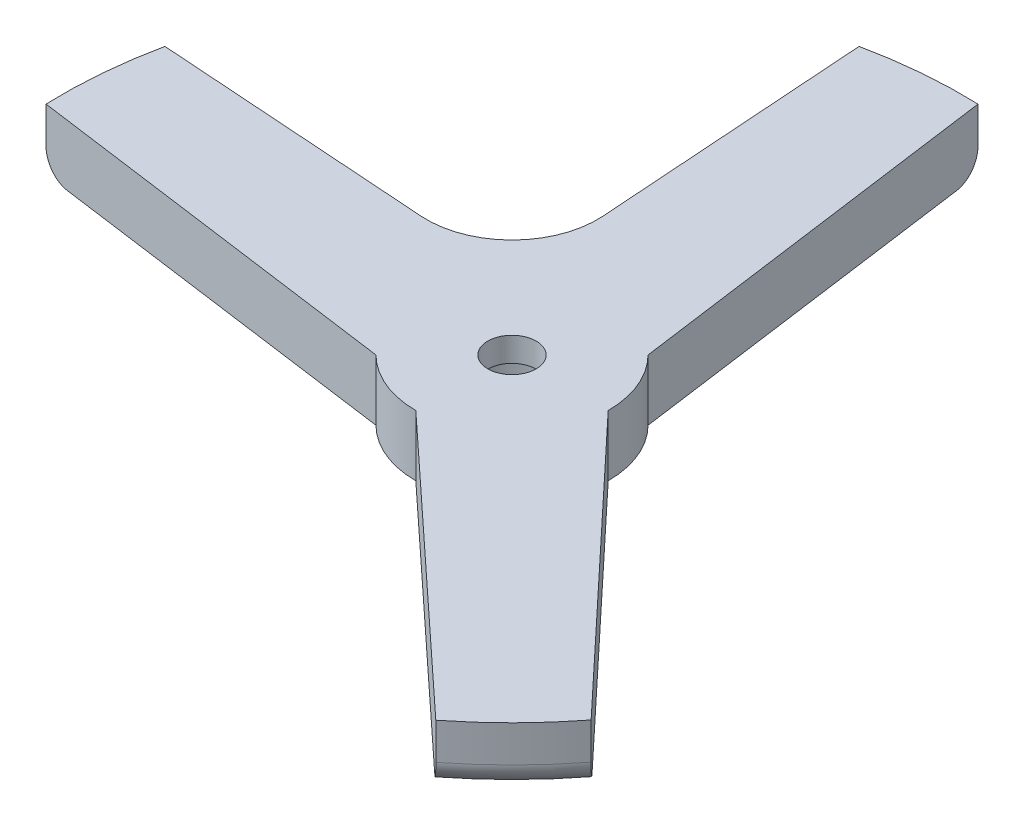
ISO-10303-21;
HEADER;
FILE_DESCRIPTION(('STEP AP214'),'2;1');
FILE_NAME('part.step','',(''),(''),'','','');
FILE_SCHEMA(('AUTOMOTIVE_DESIGN { 1 0 10303 214 1 1 1 1 }'));
ENDSEC;
DATA;
#1=APPLICATION_CONTEXT('core data for automotive mechanical design processes');
#2=APPLICATION_PROTOCOL_DEFINITION('international standard','automotive_design',2000,#1);
#3=PRODUCT_CONTEXT('',#1,'mechanical');
#4=PRODUCT('Part','Part','',(#3));
#5=PRODUCT_RELATED_PRODUCT_CATEGORY('part','',(#4));
#6=PRODUCT_DEFINITION_FORMATION('','',#4);
#7=PRODUCT_DEFINITION_CONTEXT('part definition',#1,'design');
#8=PRODUCT_DEFINITION('design','',#6,#7);
#9=PRODUCT_DEFINITION_SHAPE('','',#8);
#10=(LENGTH_UNIT() NAMED_UNIT(*) SI_UNIT(.MILLI.,.METRE.));
#11=(NAMED_UNIT(*) PLANE_ANGLE_UNIT() SI_UNIT($,.RADIAN.));
#12=(NAMED_UNIT(*) SI_UNIT($,.STERADIAN.) SOLID_ANGLE_UNIT());
#13=UNCERTAINTY_MEASURE_WITH_UNIT(LENGTH_MEASURE(1.E-05),#10,'distance_accuracy_value','');
#14=(GEOMETRIC_REPRESENTATION_CONTEXT(3) GLOBAL_UNCERTAINTY_ASSIGNED_CONTEXT((#13)) GLOBAL_UNIT_ASSIGNED_CONTEXT((#10,
#11,#12)) REPRESENTATION_CONTEXT('',''));
#15=CARTESIAN_POINT('',(0.,0.,0.));
#16=DIRECTION('',(0.,0.,1.));
#17=DIRECTION('',(1.,0.,0.));
#18=AXIS2_PLACEMENT_3D('',#15,#16,#17);
#19=CARTESIAN_POINT('',(0.,15.,0.));
#20=DIRECTION('',(0.,-1.,0.));
#21=DIRECTION('',(0.,0.,-1.));
#22=AXIS2_PLACEMENT_3D('',#19,#20,#21);
#23=CYLINDRICAL_SURFACE('',#22,37.);
#24=CARTESIAN_POINT('',(0.,-32.,0.));
#25=DIRECTION('',(0.,1.,0.));
#26=DIRECTION('',(0.,0.,1.));
#27=AXIS2_PLACEMENT_3D('',#24,#25,#26);
#28=CIRCLE('',#27,37.);
#29=CARTESIAN_POINT('',(22.8465313192423,-32.,29.1038830172003));
#30=VERTEX_POINT('',#29);
#31=CARTESIAN_POINT('',(29.2087582481236,-32.,22.7122971449977));
#32=VERTEX_POINT('',#31);
#33=EDGE_CURVE('E161',#30,#32,#28,.T.);
#34=ORIENTED_EDGE('',*,*,#33,.F.);
#35=DIRECTION('',(0.,1.,0.));
#36=VECTOR('',#35,1.);
#37=CARTESIAN_POINT('',(22.8465313192423,-37.,29.1038830172003));
#38=LINE('',#37,#36);
#39=CARTESIAN_POINT('',(22.8465313192423,-35.,29.1038830172003));
#40=VERTEX_POINT('',#39);
#41=EDGE_CURVE('E146',#40,#30,#38,.T.);
#42=ORIENTED_EDGE('',*,*,#41,.F.);
#43=CARTESIAN_POINT('',(0.,-35.,0.));
#44=DIRECTION('',(0.,-1.,0.));
#45=DIRECTION('',(0.,0.,-1.));
#46=AXIS2_PLACEMENT_3D('',#43,#44,#45);
#47=CIRCLE('',#46,37.);
#48=CARTESIAN_POINT('',(29.2087582481236,-35.,22.7122971449977));
#49=VERTEX_POINT('',#48);
#50=EDGE_CURVE('E159',#40,#49,#47,.F.);
#51=ORIENTED_EDGE('',*,*,#50,.T.);
#52=DIRECTION('',(0.,1.,0.));
#53=VECTOR('',#52,1.);
#54=CARTESIAN_POINT('',(29.2087582481236,-37.,22.7122971449977));
#55=LINE('',#54,#53);
#56=EDGE_CURVE('E162',#49,#32,#55,.T.);
#57=ORIENTED_EDGE('',*,*,#56,.T.);
#58=EDGE_LOOP('',(#34,#42,#51,#57));
#59=FACE_BOUND('',#58,.T.);
#60=ADVANCED_FACE('F37',(#59),#23,.T.);
#61=CARTESIAN_POINT('',(1.29128137799266,-32.,-36.9774605997065));
#62=VERTEX_POINT('',#61);
#63=CARTESIAN_POINT('',(-7.69273256025703,-32.,-36.1914612271508));
#64=VERTEX_POINT('',#63);
#65=EDGE_CURVE('E292',#62,#64,#28,.T.);
#66=ORIENTED_EDGE('',*,*,#65,.F.);
#67=DIRECTION('',(0.,1.,0.));
#68=VECTOR('',#67,1.);
#69=CARTESIAN_POINT('',(1.29128137799266,-37.,-36.9774605997065));
#70=LINE('',#69,#68);
#71=CARTESIAN_POINT('',(1.29128137799266,-35.,-36.9774605997065));
#72=VERTEX_POINT('',#71);
#73=EDGE_CURVE('E332',#72,#62,#70,.T.);
#74=ORIENTED_EDGE('',*,*,#73,.F.);
#75=CARTESIAN_POINT('',(0.,-35.,0.));
#76=DIRECTION('',(0.,-1.,0.));
#77=DIRECTION('',(0.,0.,-1.));
#78=AXIS2_PLACEMENT_3D('',#75,#76,#77);
#79=CIRCLE('',#78,37.);
#80=CARTESIAN_POINT('',(-7.69273256025703,-35.,-36.1914612271508));
#81=VERTEX_POINT('',#80);
#82=EDGE_CURVE('E172',#72,#81,#79,.F.);
#83=ORIENTED_EDGE('',*,*,#82,.T.);
#84=DIRECTION('',(0.,1.,0.));
#85=VECTOR('',#84,1.);
#86=CARTESIAN_POINT('',(-7.69273256025703,-37.,-36.1914612271508));
#87=LINE('',#86,#85);
#88=EDGE_CURVE('E163',#81,#64,#87,.T.);
#89=ORIENTED_EDGE('',*,*,#88,.T.);
#90=EDGE_LOOP('',(#66,#74,#83,#89));
#91=FACE_BOUND('',#90,.T.);
#92=ADVANCED_FACE('F269',(#91),#23,.T.);
#93=CARTESIAN_POINT('',(-36.1914612271508,-32.,-7.6927325602571));
#94=VERTEX_POINT('',#93);
#95=CARTESIAN_POINT('',(-36.9774605997065,-32.,1.29128137799258));
#96=VERTEX_POINT('',#95);
#97=EDGE_CURVE('E283',#94,#96,#28,.T.);
#98=ORIENTED_EDGE('',*,*,#97,.F.);
#99=DIRECTION('',(0.,1.,0.));
#100=VECTOR('',#99,1.);
#101=CARTESIAN_POINT('',(-36.1914612271508,-37.,-7.6927325602571));
#102=LINE('',#101,#100);
#103=CARTESIAN_POINT('',(-36.1914612271508,-35.,-7.6927325602571));
#104=VERTEX_POINT('',#103);
#105=EDGE_CURVE('E285',#104,#94,#102,.T.);
#106=ORIENTED_EDGE('',*,*,#105,.F.);
#107=CARTESIAN_POINT('',(0.,-35.,0.));
#108=DIRECTION('',(0.,-1.,0.));
#109=DIRECTION('',(0.,0.,-1.));
#110=AXIS2_PLACEMENT_3D('',#107,#108,#109);
#111=CIRCLE('',#110,37.);
#112=CARTESIAN_POINT('',(-36.9774605997065,-35.,1.29128137799258));
#113=VERTEX_POINT('',#112);
#114=EDGE_CURVE('E168',#104,#113,#111,.F.);
#115=ORIENTED_EDGE('',*,*,#114,.T.);
#116=DIRECTION('',(0.,1.,0.));
#117=VECTOR('',#116,1.);
#118=CARTESIAN_POINT('',(-36.9774605997065,-37.,1.29128137799258));
#119=LINE('',#118,#117);
#120=EDGE_CURVE('E288',#113,#96,#119,.T.);
#121=ORIENTED_EDGE('',*,*,#120,.T.);
#122=EDGE_LOOP('',(#98,#106,#115,#121));
#123=FACE_BOUND('',#122,.T.);
#124=ADVANCED_FACE('F270',(#123),#23,.T.);
#125=CARTESIAN_POINT('',(0.,-37.,0.));
#126=DIRECTION('',(0.,-1.,0.));
#127=DIRECTION('',(0.,0.,-1.));
#128=AXIS2_PLACEMENT_3D('',#125,#126,#127);
#129=PLANE('',#128);
#130=DIRECTION('',(0.997639543397483,0.,0.0686683438686374));
#131=VECTOR('',#130,1.);
#132=CARTESIAN_POINT('',(-36.1914612271508,-37.,-7.6927325602571));
#133=LINE('',#132,#131);
#134=CARTESIAN_POINT('',(-34.1751066058086,-37.,-7.55394522627882));
#135=VERTEX_POINT('',#134);
#136=CARTESIAN_POINT('',(-13.6020394357341,-37.,-6.13788422487123));
#137=VERTEX_POINT('',#136);
#138=EDGE_CURVE('E342',#135,#137,#133,.T.);
#139=ORIENTED_EDGE('',*,*,#138,.T.);
#140=CARTESIAN_POINT('',(-13.1213610286536,-37.,-13.1213610286536));
#141=DIRECTION('',(0.,-1.,0.));
#142=DIRECTION('',(0.,0.,-1.));
#143=AXIS2_PLACEMENT_3D('',#140,#141,#142);
#144=CIRCLE('',#143,7.);
#145=CARTESIAN_POINT('',(-6.13788422487122,-37.,-13.6020394357341));
#146=VERTEX_POINT('',#145);
#147=EDGE_CURVE('E45',#137,#146,#144,.F.);
#148=ORIENTED_EDGE('',*,*,#147,.T.);
#149=DIRECTION('',(-0.068668343868635,0.,-0.997639543397483));
#150=VECTOR('',#149,1.);
#151=CARTESIAN_POINT('',(-7.69273256025703,-37.,-36.1914612271508));
#152=LINE('',#151,#150);
#153=CARTESIAN_POINT('',(-7.55394522627876,-37.,-34.1751066058086));
#154=VERTEX_POINT('',#153);
#155=EDGE_CURVE('E349',#146,#154,#152,.T.);
#156=ORIENTED_EDGE('',*,*,#155,.T.);
#157=CARTESIAN_POINT('',(0.,-37.,0.));
#158=DIRECTION('',(0.,-1.,0.));
#159=DIRECTION('',(0.,0.,-1.));
#160=AXIS2_PLACEMENT_3D('',#157,#158,#159);
#161=CIRCLE('',#160,35.);
#162=CARTESIAN_POINT('',(1.56663083980371,-37.,-34.9649205320386));
#163=VERTEX_POINT('',#162);
#164=EDGE_CURVE('E170',#154,#163,#161,.T.);
#165=ORIENTED_EDGE('',*,*,#164,.T.);
#166=DIRECTION('',(0.135554057971971,0.,0.990769951788674));
#167=VECTOR('',#166,1.);
#168=CARTESIAN_POINT('',(1.29128137799266,-37.,-36.9774605997065));
#169=LINE('',#168,#167);
#170=CARTESIAN_POINT('',(5.58614357137372,-37.,-5.58614357137372));
#171=VERTEX_POINT('',#170);
#172=EDGE_CURVE('E353',#163,#171,#169,.T.);
#173=ORIENTED_EDGE('',*,*,#172,.T.);
#174=CARTESIAN_POINT('',(0.,-37.,0.));
#175=DIRECTION('',(0.,-1.,0.));
#176=DIRECTION('',(0.,0.,-1.));
#177=AXIS2_PLACEMENT_3D('',#174,#175,#176);
#178=CIRCLE('',#177,7.9);
#179=CARTESIAN_POINT('',(7.9,-37.,0.));
#180=VERTEX_POINT('',#179);
#181=EDGE_CURVE('E379',#171,#180,#178,.T.);
#182=ORIENTED_EDGE('',*,*,#181,.T.);
#183=DIRECTION('',(0.684214165270186,0.,0.729281136492384));
#184=VECTOR('',#183,1.);
#185=CARTESIAN_POINT('',(7.9,-37.,0.));
#186=LINE('',#185,#184);
#187=CARTESIAN_POINT('',(27.8224475975923,-37.,21.2346747015166));
#188=VERTEX_POINT('',#187);
#189=EDGE_CURVE('E314',#180,#188,#186,.T.);
#190=ORIENTED_EDGE('',*,*,#189,.T.);
#191=CARTESIAN_POINT('',(0.,-37.,0.));
#192=DIRECTION('',(0.,-1.,0.));
#193=DIRECTION('',(0.,0.,-1.));
#194=AXIS2_PLACEMENT_3D('',#191,#192,#193);
#195=CIRCLE('',#194,35.);
#196=CARTESIAN_POINT('',(21.3612459680109,-37.,27.7253885580372));
#197=VERTEX_POINT('',#196);
#198=EDGE_CURVE('E335',#188,#197,#195,.T.);
#199=ORIENTED_EDGE('',*,*,#198,.T.);
#200=DIRECTION('',(-0.732965488555828,0.,-0.680265824943541));
#201=VECTOR('',#200,1.);
#202=CARTESIAN_POINT('',(0.,-37.,7.9));
#203=LINE('',#202,#201);
#204=CARTESIAN_POINT('',(0.,-37.,7.9));
#205=VERTEX_POINT('',#204);
#206=EDGE_CURVE('E149',#197,#205,#203,.T.);
#207=ORIENTED_EDGE('',*,*,#206,.T.);
#208=CARTESIAN_POINT('',(0.,-37.,0.));
#209=DIRECTION('',(0.,-1.,0.));
#210=DIRECTION('',(0.,0.,-1.));
#211=AXIS2_PLACEMENT_3D('',#208,#209,#210);
#212=CIRCLE('',#211,7.9);
#213=CARTESIAN_POINT('',(-5.58614357137372,-37.,5.58614357137373));
#214=VERTEX_POINT('',#213);
#215=EDGE_CURVE('E351',#205,#214,#212,.T.);
#216=ORIENTED_EDGE('',*,*,#215,.T.);
#217=DIRECTION('',(-0.990769951788674,0.,-0.135554057971974));
#218=VECTOR('',#217,1.);
#219=CARTESIAN_POINT('',(-36.9774605997065,-37.,1.29128137799258));
#220=LINE('',#219,#218);
#221=CARTESIAN_POINT('',(-34.9649205320386,-37.,1.56663083980364));
#222=VERTEX_POINT('',#221);
#223=EDGE_CURVE('E348',#214,#222,#220,.T.);
#224=ORIENTED_EDGE('',*,*,#223,.T.);
#225=CARTESIAN_POINT('',(0.,-37.,0.));
#226=DIRECTION('',(0.,-1.,0.));
#227=DIRECTION('',(0.,0.,-1.));
#228=AXIS2_PLACEMENT_3D('',#225,#226,#227);
#229=CIRCLE('',#228,35.);
#230=EDGE_CURVE('E347',#222,#135,#229,.T.);
#231=ORIENTED_EDGE('',*,*,#230,.T.);
#232=EDGE_LOOP('',(#139,#148,#156,#165,#173,#182,#190,#199,#207,#216,#224,#231));
#233=FACE_BOUND('',#232,.T.);
#234=CARTESIAN_POINT('',(0.,-37.,0.));
#235=DIRECTION('',(0.,-1.,0.));
#236=DIRECTION('',(0.,0.,-1.));
#237=AXIS2_PLACEMENT_3D('',#234,#235,#236);
#238=CIRCLE('',#237,6.15);
#239=CARTESIAN_POINT('',(0.,-37.,-6.15));
#240=VERTEX_POINT('',#239);
#241=EDGE_CURVE('E323',#240,#240,#238,.T.);
#242=ORIENTED_EDGE('',*,*,#241,.F.);
#243=EDGE_LOOP('',(#242));
#244=FACE_BOUND('',#243,.T.);
#245=ADVANCED_FACE('F196',(#233,#244),#129,.T.);
#246=CARTESIAN_POINT('',(0.,-32.,0.));
#247=DIRECTION('',(0.,-1.,0.));
#248=DIRECTION('',(0.,0.,-1.));
#249=AXIS2_PLACEMENT_3D('',#246,#247,#248);
#250=CYLINDRICAL_SURFACE('',#249,1.984375);
#251=CARTESIAN_POINT('',(0.,-32.,0.));
#252=DIRECTION('',(0.,-1.,0.));
#253=DIRECTION('',(0.,0.,-1.));
#254=AXIS2_PLACEMENT_3D('',#251,#252,#253);
#255=CIRCLE('',#254,1.984375);
#256=CARTESIAN_POINT('',(0.,-32.,-1.984375));
#257=VERTEX_POINT('',#256);
#258=EDGE_CURVE('E315',#257,#257,#255,.T.);
#259=ORIENTED_EDGE('',*,*,#258,.F.);
#260=EDGE_LOOP('',(#259));
#261=FACE_BOUND('',#260,.T.);
#262=CARTESIAN_POINT('',(0.,-34.,0.));
#263=DIRECTION('',(0.,-1.,0.));
#264=DIRECTION('',(0.,0.,-1.));
#265=AXIS2_PLACEMENT_3D('',#262,#263,#264);
#266=CIRCLE('',#265,1.984375);
#267=CARTESIAN_POINT('',(0.,-34.,-1.984375));
#268=VERTEX_POINT('',#267);
#269=EDGE_CURVE('E318',#268,#268,#266,.F.);
#270=ORIENTED_EDGE('',*,*,#269,.F.);
#271=EDGE_LOOP('',(#270));
#272=FACE_BOUND('',#271,.T.);
#273=ADVANCED_FACE('F280',(#261,#272),#250,.F.);
#274=CARTESIAN_POINT('',(7.9,-32.,0.));
#275=DIRECTION('',(0.729281136492384,0.,-0.684214165270186));
#276=DIRECTION('',(-0.684214165270186,0.,-0.729281136492384));
#277=AXIS2_PLACEMENT_3D('',#274,#275,#276);
#278=PLANE('',#277);
#279=ORIENTED_EDGE('',*,*,#56,.F.);
#280=CARTESIAN_POINT('',(29.2087582481236,-35.,22.7122971449977));
#281=CARTESIAN_POINT('',(29.20875822779,-35.0557630965855,22.7122971233248));
#282=CARTESIAN_POINT('',(29.2071418260147,-35.1114993120202,22.7105742543993));
#283=CARTESIAN_POINT('',(29.2006949368529,-35.2225692292145,22.7037027295268));
#284=CARTESIAN_POINT('',(29.1958646782454,-35.2779029593417,22.6985543174277));
#285=CARTESIAN_POINT('',(29.176606217041,-35.4425718251851,22.6780273637528));
#286=CARTESIAN_POINT('',(29.1574101570931,-35.5507979938055,22.6575669215031));
#287=CARTESIAN_POINT('',(29.1068725311435,-35.7609914040277,22.6037005457995));
#288=CARTESIAN_POINT('',(29.075526513721,-35.8629563358,22.5702898677242));
#289=CARTESIAN_POINT('',(29.0016266932841,-36.0578054446676,22.4915225054415));
#290=CARTESIAN_POINT('',(28.9590738214319,-36.150690375329,22.4461668137289));
#291=CARTESIAN_POINT('',(28.8637627210728,-36.3252848889299,22.3445778798565));
#292=CARTESIAN_POINT('',(28.8109529959521,-36.406934371268,22.2882897491676));
#293=CARTESIAN_POINT('',(28.6967897182499,-36.5563124440695,22.1666069060837));
#294=CARTESIAN_POINT('',(28.6354343637445,-36.6240380910882,22.1012102730779));
#295=CARTESIAN_POINT('',(28.5051668564215,-36.7444825425909,21.962362466922));
#296=CARTESIAN_POINT('',(28.4361741409069,-36.7970150112516,21.888825424671));
#297=CARTESIAN_POINT('',(28.2931924669553,-36.8846144726145,21.7364260109059));
#298=CARTESIAN_POINT('',(28.2192054725813,-36.9196882862322,21.6575657328211));
#299=CARTESIAN_POINT('',(28.0911364943401,-36.963676372503,21.5210612657376));
#300=CARTESIAN_POINT('',(28.0377866209278,-36.9772910522329,21.4641974089385));
#301=CARTESIAN_POINT('',(27.9304467821274,-36.9954523219353,21.349787442579));
#302=CARTESIAN_POINT('',(27.8764578451485,-37.0000118967839,21.2922424291658));
#303=CARTESIAN_POINT('',(27.8224475975923,-37.,21.2346747015166));
#304=B_SPLINE_CURVE_WITH_KNOTS('',3,(#280,#281,#282,#283,#284,#285,#286,#287,#288,#289,#290,
#291,#292,#293,#294,#295,#296,#297,#298,#299,#300,#301,#302,#303),.UNSPECIFIED.,.F.,.F.,(4,2,2,
2,2,2,2,2,2,2,2,4),(0.,0.167185963020046,0.334360026153862,0.668046655739626,1.00185565495187,
1.33563692717965,1.6711394844227,2.00671289284334,2.34624252999988,2.68563941212802,
2.9225999062218,3.15922035667885),.UNSPECIFIED.);
#305=EDGE_CURVE('E155',#49,#188,#304,.T.);
#306=ORIENTED_EDGE('',*,*,#305,.T.);
#307=ORIENTED_EDGE('',*,*,#189,.F.);
#308=DIRECTION('',(0.,-1.,0.));
#309=VECTOR('',#308,1.);
#310=CARTESIAN_POINT('',(7.9,-32.,0.));
#311=LINE('',#310,#309);
#312=CARTESIAN_POINT('',(7.9,-32.,0.));
#313=VERTEX_POINT('',#312);
#314=EDGE_CURVE('E340',#313,#180,#311,.T.);
#315=ORIENTED_EDGE('',*,*,#314,.F.);
#316=DIRECTION('',(0.684214165270186,0.,0.729281136492384));
#317=VECTOR('',#316,1.);
#318=CARTESIAN_POINT('',(7.9,-32.,0.));
#319=LINE('',#318,#317);
#320=EDGE_CURVE('E360',#313,#32,#319,.T.);
#321=ORIENTED_EDGE('',*,*,#320,.T.);
#322=EDGE_LOOP('',(#279,#306,#307,#315,#321));
#323=FACE_BOUND('',#322,.T.);
#324=ADVANCED_FACE('F400',(#323),#278,.T.);
#325=CARTESIAN_POINT('',(0.,-32.,0.));
#326=DIRECTION('',(0.,-1.,0.));
#327=DIRECTION('',(0.,0.,-1.));
#328=AXIS2_PLACEMENT_3D('',#325,#326,#327);
#329=CYLINDRICAL_SURFACE('',#328,7.9);
#330=ORIENTED_EDGE('',*,*,#181,.F.);
#331=DIRECTION('',(0.,-1.,0.));
#332=VECTOR('',#331,1.);
#333=CARTESIAN_POINT('',(5.58614357137372,-32.,-5.58614357137372));
#334=LINE('',#333,#332);
#335=CARTESIAN_POINT('',(5.58614357137372,-32.,-5.58614357137372));
#336=VERTEX_POINT('',#335);
#337=EDGE_CURVE('E371',#336,#171,#334,.T.);
#338=ORIENTED_EDGE('',*,*,#337,.F.);
#339=CARTESIAN_POINT('',(0.,-32.,0.));
#340=DIRECTION('',(0.,-1.,0.));
#341=DIRECTION('',(0.,0.,-1.));
#342=AXIS2_PLACEMENT_3D('',#339,#340,#341);
#343=CIRCLE('',#342,7.9);
#344=EDGE_CURVE('E363',#336,#313,#343,.T.);
#345=ORIENTED_EDGE('',*,*,#344,.T.);
#346=ORIENTED_EDGE('',*,*,#314,.T.);
#347=EDGE_LOOP('',(#330,#338,#345,#346));
#348=FACE_BOUND('',#347,.T.);
#349=ADVANCED_FACE('F377',(#348),#329,.T.);
#350=CARTESIAN_POINT('',(1.29128137799266,-32.,-36.9774605997065));
#351=DIRECTION('',(0.990769951788674,0.,-0.135554057971971));
#352=DIRECTION('',(-0.135554057971971,0.,-0.990769951788674));
#353=AXIS2_PLACEMENT_3D('',#350,#351,#352);
#354=PLANE('',#353);
#355=ORIENTED_EDGE('',*,*,#172,.F.);
#356=CARTESIAN_POINT('',(1.56663083980371,-37.,-34.9649205320386));
#357=CARTESIAN_POINT('',(1.55879166800627,-36.9999991187724,-35.0222173476412));
#358=CARTESIAN_POINT('',(1.55095619694411,-36.9975712807459,-35.0794871144239));
#359=CARTESIAN_POINT('',(1.53534048184204,-36.9878798886194,-35.1936229915071));
#360=CARTESIAN_POINT('',(1.52756023738331,-36.9806163712316,-35.250489104869));
#361=CARTESIAN_POINT('',(1.50439174714069,-36.9516218727346,-35.4198285131029));
#362=CARTESIAN_POINT('',(1.48915742445432,-36.9226868464697,-35.5311767779895));
#363=CARTESIAN_POINT('',(1.45956223812748,-36.8463163088982,-35.7474891611738));
#364=CARTESIAN_POINT('',(1.44520197461113,-36.7988682486531,-35.8524488931408));
#365=CARTESIAN_POINT('',(1.41777950333493,-36.6867257561472,-36.0528808163951));
#366=CARTESIAN_POINT('',(1.40471687247933,-36.6220369707633,-36.1483561001059));
#367=CARTESIAN_POINT('',(1.380379340868,-36.4777632360926,-36.3262400777748));
#368=CARTESIAN_POINT('',(1.36909063922296,-36.3983049861915,-36.4087496429767));
#369=CARTESIAN_POINT('',(1.34851234108252,-36.2263245418667,-36.5591572350586));
#370=CARTESIAN_POINT('',(1.33922307746058,-36.1338001763899,-36.6270528289534));
#371=CARTESIAN_POINT('',(1.32305642325185,-35.9398016757259,-36.7452155416793));
#372=CARTESIAN_POINT('',(1.31614566468189,-35.8384786636103,-36.7957265484143));
#373=CARTESIAN_POINT('',(1.30476717521898,-35.6286622936661,-36.8788923763154));
#374=CARTESIAN_POINT('',(1.30029748789122,-35.5201747563652,-36.9115614971406));
#375=CARTESIAN_POINT('',(1.29517727231272,-35.3423938604584,-36.9489853545873));
#376=CARTESIAN_POINT('',(1.29371712961096,-35.2743132518065,-36.9596575951374));
#377=CARTESIAN_POINT('',(1.29176944152883,-35.1374989274498,-36.9738933240865));
#378=CARTESIAN_POINT('',(1.29128049183489,-35.0687662993584,-36.9774670766686));
#379=CARTESIAN_POINT('',(1.29128137799266,-35.,-36.9774605997065));
#380=B_SPLINE_CURVE_WITH_KNOTS('',3,(#356,#357,#358,#359,#360,#361,#362,#363,#364,#365,#366,
#367,#368,#369,#370,#371,#372,#373,#374,#375,#376,#377,#378,#379),.UNSPECIFIED.,.F.,.F.,(4,2,2,
2,2,2,2,2,2,2,2,4),(0.,0.173386359724368,0.346771403122868,0.693141160883746,1.03974611214048,
1.3862376786481,1.72988364637631,2.07358678131522,2.41225021105274,2.75064181385957,
2.95707912928165,3.16321772511251),.UNSPECIFIED.);
#381=EDGE_CURVE('E167',#163,#72,#380,.T.);
#382=ORIENTED_EDGE('',*,*,#381,.T.);
#383=ORIENTED_EDGE('',*,*,#73,.T.);
#384=DIRECTION('',(0.135554057971971,0.,0.990769951788674));
#385=VECTOR('',#384,1.);
#386=CARTESIAN_POINT('',(1.29128137799266,-32.,-36.9774605997065));
#387=LINE('',#386,#385);
#388=EDGE_CURVE('E306',#62,#336,#387,.T.);
#389=ORIENTED_EDGE('',*,*,#388,.T.);
#390=ORIENTED_EDGE('',*,*,#337,.T.);
#391=EDGE_LOOP('',(#355,#382,#383,#389,#390));
#392=FACE_BOUND('',#391,.T.);
#393=ADVANCED_FACE('F183',(#392),#354,.T.);
#394=CARTESIAN_POINT('',(-7.69273256025703,-32.,-36.1914612271508));
#395=DIRECTION('',(-0.997639543397483,0.,0.068668343868635));
#396=DIRECTION('',(0.068668343868635,0.,0.997639543397483));
#397=AXIS2_PLACEMENT_3D('',#394,#395,#396);
#398=PLANE('',#397);
#399=ORIENTED_EDGE('',*,*,#155,.F.);
#400=DIRECTION('',(0.,-1.,0.));
#401=VECTOR('',#400,1.);
#402=CARTESIAN_POINT('',(-6.13788422487122,-32.,-13.6020394357341));
#403=LINE('',#402,#401);
#404=CARTESIAN_POINT('',(-6.13788422487122,-32.,-13.6020394357341));
#405=VERTEX_POINT('',#404);
#406=EDGE_CURVE('E52',#146,#405,#403,.F.);
#407=ORIENTED_EDGE('',*,*,#406,.T.);
#408=DIRECTION('',(-0.068668343868635,0.,-0.997639543397483));
#409=VECTOR('',#408,1.);
#410=CARTESIAN_POINT('',(-7.69273256025703,-32.,-36.1914612271508));
#411=LINE('',#410,#409);
#412=EDGE_CURVE('E302',#405,#64,#411,.T.);
#413=ORIENTED_EDGE('',*,*,#412,.T.);
#414=ORIENTED_EDGE('',*,*,#88,.F.);
#415=CARTESIAN_POINT('',(-7.69273256025703,-35.,-36.1914612271508));
#416=CARTESIAN_POINT('',(-7.69273255374611,-35.0558590275539,-36.1914611325577));
#417=CARTESIAN_POINT('',(-7.69257015672781,-35.1116911599323,-36.189101767557));
#418=CARTESIAN_POINT('',(-7.69192241878504,-35.2229529235725,-36.179691186945));
#419=CARTESIAN_POINT('',(-7.69143709942289,-35.2783825814586,-36.1726402845992));
#420=CARTESIAN_POINT('',(-7.68950195603351,-35.4433450278427,-36.1445257931374));
#421=CARTESIAN_POINT('',(-7.6875729303218,-35.5517680205479,-36.1165001815994));
#422=CARTESIAN_POINT('',(-7.682493470024,-35.762348050519,-36.0427038707126));
#423=CARTESIAN_POINT('',(-7.67934256148439,-35.8645026385162,-35.9969262855891));
#424=CARTESIAN_POINT('',(-7.67191275011478,-36.0597048425642,-35.8889831897647));
#425=CARTESIAN_POINT('',(-7.6676339608453,-36.1527533741645,-35.826819328914));
#426=CARTESIAN_POINT('',(-7.65805304800631,-36.327543342645,-35.6876242213648));
#427=CARTESIAN_POINT('',(-7.65274671483711,-36.4092358065866,-35.6105318160176));
#428=CARTESIAN_POINT('',(-7.64127432530779,-36.5586505267087,-35.4438566232447));
#429=CARTESIAN_POINT('',(-7.63510808981755,-36.6263698647772,-35.3542712333489));
#430=CARTESIAN_POINT('',(-7.62202953892811,-36.7465918630001,-35.1642611238493));
#431=CARTESIAN_POINT('',(-7.61511063417352,-36.7989423265222,-35.0637406716102));
#432=CARTESIAN_POINT('',(-7.60077253869658,-36.8861485562896,-34.8554314243075));
#433=CARTESIAN_POINT('',(-7.59335356330176,-36.9210117985273,-34.7476457576031));
#434=CARTESIAN_POINT('',(-7.58057242690441,-36.9644048545312,-34.561956597778));
#435=CARTESIAN_POINT('',(-7.57528480215447,-36.977746156714,-34.4851359953868));
#436=CARTESIAN_POINT('',(-7.56464718441705,-36.995543087976,-34.3305886813771));
#437=CARTESIAN_POINT('',(-7.55929729154505,-37.0000114095532,-34.2528634242737));
#438=CARTESIAN_POINT('',(-7.55394522627876,-37.,-34.1751066058086));
#439=B_SPLINE_CURVE_WITH_KNOTS('',3,(#415,#416,#417,#418,#419,#420,#421,#422,#423,#424,#425,
#426,#427,#428,#429,#430,#431,#432,#433,#434,#435,#436,#437,#438),.UNSPECIFIED.,.F.,.F.,(4,2,2,
2,2,2,2,2,2,2,2,4),(0.,0.167473689087184,0.334936196665091,0.669219329841959,1.00363225729067,
1.33801152726758,1.67379081287466,2.00964015095932,2.34871111127328,2.68763699095698,
2.92160454949441,3.15523718358104),.UNSPECIFIED.);
#440=EDGE_CURVE('E200',#81,#154,#439,.T.);
#441=ORIENTED_EDGE('',*,*,#440,.T.);
#442=EDGE_LOOP('',(#399,#407,#413,#414,#441));
#443=FACE_BOUND('',#442,.T.);
#444=ADVANCED_FACE('F214',(#443),#398,.T.);
#445=CARTESIAN_POINT('',(-36.1914612271508,-32.,-7.6927325602571));
#446=DIRECTION('',(0.0686683438686374,0.,-0.997639543397483));
#447=DIRECTION('',(-0.997639543397483,0.,-0.0686683438686374));
#448=AXIS2_PLACEMENT_3D('',#445,#446,#447);
#449=PLANE('',#448);
#450=DIRECTION('',(0.997639543397483,0.,0.0686683438686374));
#451=VECTOR('',#450,1.);
#452=CARTESIAN_POINT('',(-36.1914612271508,-32.,-7.6927325602571));
#453=LINE('',#452,#451);
#454=CARTESIAN_POINT('',(-13.6020394357341,-32.,-6.13788422487123));
#455=VERTEX_POINT('',#454);
#456=EDGE_CURVE('E296',#94,#455,#453,.T.);
#457=ORIENTED_EDGE('',*,*,#456,.T.);
#458=DIRECTION('',(0.,-1.,0.));
#459=VECTOR('',#458,1.);
#460=CARTESIAN_POINT('',(-13.6020394357341,-37.,-6.13788422487123));
#461=LINE('',#460,#459);
#462=EDGE_CURVE('E330',#455,#137,#461,.T.);
#463=ORIENTED_EDGE('',*,*,#462,.T.);
#464=ORIENTED_EDGE('',*,*,#138,.F.);
#465=CARTESIAN_POINT('',(-34.1751066058086,-37.,-7.55394522627882));
#466=CARTESIAN_POINT('',(-34.2322904091651,-36.9999992857733,-7.55788123412714));
#467=CARTESIAN_POINT('',(-34.2894470902884,-36.9975885675706,-7.56181537513001));
#468=CARTESIAN_POINT('',(-34.4033556384447,-36.9879673791973,-7.56965579345158));
#469=CARTESIAN_POINT('',(-34.4601075138341,-36.9807570083997,-7.57356207134545));
#470=CARTESIAN_POINT('',(-34.6290851758626,-36.9519819346512,-7.58519294171249));
#471=CARTESIAN_POINT('',(-34.7401854459335,-36.9232731454522,-7.59284006396182));
#472=CARTESIAN_POINT('',(-34.9560062336125,-36.8475391393263,-7.60769518489245));
#473=CARTESIAN_POINT('',(-35.0607227908227,-36.8005026831612,-7.61490291097632));
#474=CARTESIAN_POINT('',(-35.2607202780051,-36.6893882158278,-7.62866890122159));
#475=CARTESIAN_POINT('',(-35.3560038174202,-36.6253149357119,-7.63522734499307));
#476=CARTESIAN_POINT('',(-35.5338509997379,-36.482284848813,-7.64746871167935));
#477=CARTESIAN_POINT('',(-35.616481617536,-36.403411703153,-7.65315624453086));
#478=CARTESIAN_POINT('',(-35.7672151932694,-36.2327325823108,-7.66353135955062));
#479=CARTESIAN_POINT('',(-35.8353155803135,-36.140924323231,-7.66821876476233));
#480=CARTESIAN_POINT('',(-35.9543135145104,-35.947980081147,-7.67640948967813));
#481=CARTESIAN_POINT('',(-36.0053737850328,-35.8469448013168,-7.67992400976453));
#482=CARTESIAN_POINT('',(-36.0896447755202,-35.6376882507168,-7.68572445080683));
#483=CARTESIAN_POINT('',(-36.1228685353085,-35.5294722947707,-7.6880112693044));
#484=CARTESIAN_POINT('',(-36.1615631480206,-35.3504071493851,-7.69067465107306));
#485=CARTESIAN_POINT('',(-36.1727684527402,-35.280751027499,-7.69144592134069));
#486=CARTESIAN_POINT('',(-36.1877158490629,-35.1407403823314,-7.692474762827));
#487=CARTESIAN_POINT('',(-36.1914686468086,-35.070387007052,-7.6927330709582));
#488=CARTESIAN_POINT('',(-36.1914612271508,-35.,-7.6927325602571));
#489=B_SPLINE_CURVE_WITH_KNOTS('',3,(#465,#466,#467,#468,#469,#470,#471,#472,#473,#474,#475,
#476,#477,#478,#479,#480,#481,#482,#483,#484,#485,#486,#487,#488),.UNSPECIFIED.,.F.,.F.,(4,2,2,
2,2,2,2,2,2,2,2,4),(0.,0.171852460505343,0.34370136305582,0.68694654578219,1.03040255192349,
1.37376328124291,1.71523853310092,2.05677415351511,2.39494817449429,2.73287462713638,
2.94417335392634,3.15516831239298),.UNSPECIFIED.);
#490=EDGE_CURVE('E207',#135,#104,#489,.T.);
#491=ORIENTED_EDGE('',*,*,#490,.T.);
#492=ORIENTED_EDGE('',*,*,#105,.T.);
#493=EDGE_LOOP('',(#457,#463,#464,#491,#492));
#494=FACE_BOUND('',#493,.T.);
#495=ADVANCED_FACE('F217',(#494),#449,.T.);
#496=CARTESIAN_POINT('',(-36.9774605997065,-32.,1.29128137799258));
#497=DIRECTION('',(-0.135554057971974,0.,0.990769951788674));
#498=DIRECTION('',(0.990769951788674,0.,0.135554057971974));
#499=AXIS2_PLACEMENT_3D('',#496,#497,#498);
#500=PLANE('',#499);
#501=ORIENTED_EDGE('',*,*,#120,.F.);
#502=CARTESIAN_POINT('',(-36.9774605997065,-35.,1.29128137799258));
#503=CARTESIAN_POINT('',(-36.9774606361523,-35.0556649817743,1.29128137300619));
#504=CARTESIAN_POINT('',(-36.9751225761612,-35.111303096529,1.29160125908974));
#505=CARTESIAN_POINT('',(-36.9657978594657,-35.2221767980195,1.29287703777604));
#506=CARTESIAN_POINT('',(-36.9588115546613,-35.2774124149069,1.29383288223292));
#507=CARTESIAN_POINT('',(-36.9309590888335,-35.4417810521431,1.29764356983064));
#508=CARTESIAN_POINT('',(-36.9031991141399,-35.5498059469804,1.30144160307955));
#509=CARTESIAN_POINT('',(-36.8301284192576,-35.7596039616146,1.31143890789512));
#510=CARTESIAN_POINT('',(-36.7848116532884,-35.8613749138286,1.31763900662662));
#511=CARTESIAN_POINT('',(-36.6779954329044,-36.0558627514431,1.33225326910414));
#512=CARTESIAN_POINT('',(-36.6164970321245,-36.1485802258039,1.34066728869512));
#513=CARTESIAN_POINT('',(-36.4787097573062,-36.3229736119793,1.35951891434726));
#514=CARTESIAN_POINT('',(-36.4023323212749,-36.4045781750821,1.36996863718439));
#515=CARTESIAN_POINT('',(-36.2372389785613,-36.5539166567256,1.39255619397149));
#516=CARTESIAN_POINT('',(-36.1485204398002,-36.6216476086987,1.4046943880343));
#517=CARTESIAN_POINT('',(-35.9599595859638,-36.7423170756195,1.43049269657811));
#518=CARTESIAN_POINT('',(-35.8599786086268,-36.7950346061502,1.44417178239775));
#519=CARTESIAN_POINT('',(-35.6527653395069,-36.883034281939,1.47252205628739));
#520=CARTESIAN_POINT('',(-35.5455356226655,-36.918322581898,1.48719289206194));
#521=CARTESIAN_POINT('',(-35.3590206545535,-36.9629228728592,1.51271128889508));
#522=CARTESIAN_POINT('',(-35.2807790731349,-36.9768203511739,1.52341605829617));
#523=CARTESIAN_POINT('',(-35.1233409149543,-36.9953584677675,1.54495625658589));
#524=CARTESIAN_POINT('',(-35.0441458744866,-37.0000123981713,1.5557914752835));
#525=CARTESIAN_POINT('',(-34.9649205320386,-37.,1.56663083980364));
#526=B_SPLINE_CURVE_WITH_KNOTS('',3,(#502,#503,#504,#505,#506,#507,#508,#509,#510,#511,#512,
#513,#514,#515,#516,#517,#518,#519,#520,#521,#522,#523,#524,#525),.UNSPECIFIED.,.F.,.F.,(4,2,2,
2,2,2,2,2,2,2,2,4),(0.,0.166891686274654,0.333770739281708,0.666847425219003,1.00003891009042,
1.33320870522958,1.66842575225998,2.00371440345601,2.34370945022755,2.68358435017668,
2.92362482954148,3.16331988258791),.UNSPECIFIED.);
#527=EDGE_CURVE('E154',#113,#222,#526,.T.);
#528=ORIENTED_EDGE('',*,*,#527,.T.);
#529=ORIENTED_EDGE('',*,*,#223,.F.);
#530=DIRECTION('',(0.,-1.,0.));
#531=VECTOR('',#530,1.);
#532=CARTESIAN_POINT('',(-5.58614357137372,-32.,5.58614357137373));
#533=LINE('',#532,#531);
#534=CARTESIAN_POINT('',(-5.58614357137372,-32.,5.58614357137373));
#535=VERTEX_POINT('',#534);
#536=EDGE_CURVE('E380',#535,#214,#533,.T.);
#537=ORIENTED_EDGE('',*,*,#536,.F.);
#538=DIRECTION('',(-0.990769951788674,0.,-0.135554057971974));
#539=VECTOR('',#538,1.);
#540=CARTESIAN_POINT('',(-36.9774605997065,-32.,1.29128137799258));
#541=LINE('',#540,#539);
#542=EDGE_CURVE('E301',#535,#96,#541,.T.);
#543=ORIENTED_EDGE('',*,*,#542,.T.);
#544=EDGE_LOOP('',(#501,#528,#529,#537,#543));
#545=FACE_BOUND('',#544,.T.);
#546=ADVANCED_FACE('F221',(#545),#500,.T.);
#547=CARTESIAN_POINT('',(0.,-32.,0.));
#548=DIRECTION('',(0.,-1.,0.));
#549=DIRECTION('',(0.,0.,-1.));
#550=AXIS2_PLACEMENT_3D('',#547,#548,#549);
#551=CYLINDRICAL_SURFACE('',#550,7.9);
#552=ORIENTED_EDGE('',*,*,#215,.F.);
#553=DIRECTION('',(0.,-1.,0.));
#554=VECTOR('',#553,1.);
#555=CARTESIAN_POINT('',(0.,-32.,7.9));
#556=LINE('',#555,#554);
#557=CARTESIAN_POINT('',(0.,-32.,7.9));
#558=VERTEX_POINT('',#557);
#559=EDGE_CURVE('E364',#558,#205,#556,.T.);
#560=ORIENTED_EDGE('',*,*,#559,.F.);
#561=CARTESIAN_POINT('',(0.,-32.,0.));
#562=DIRECTION('',(0.,-1.,0.));
#563=DIRECTION('',(0.,0.,-1.));
#564=AXIS2_PLACEMENT_3D('',#561,#562,#563);
#565=CIRCLE('',#564,7.9);
#566=EDGE_CURVE('E304',#558,#535,#565,.T.);
#567=ORIENTED_EDGE('',*,*,#566,.T.);
#568=ORIENTED_EDGE('',*,*,#536,.T.);
#569=EDGE_LOOP('',(#552,#560,#567,#568));
#570=FACE_BOUND('',#569,.T.);
#571=ADVANCED_FACE('F226',(#570),#551,.T.);
#572=CARTESIAN_POINT('',(0.,-32.,7.9));
#573=DIRECTION('',(-0.680265824943541,0.,0.732965488555828));
#574=DIRECTION('',(0.732965488555828,0.,0.680265824943541));
#575=AXIS2_PLACEMENT_3D('',#572,#573,#574);
#576=PLANE('',#575);
#577=ORIENTED_EDGE('',*,*,#206,.F.);
#578=CARTESIAN_POINT('',(21.3612459680109,-37.,27.7253885580372));
#579=CARTESIAN_POINT('',(21.4034532765887,-36.9999991993012,27.7645611930884));
#580=CARTESIAN_POINT('',(21.4456406151553,-36.9975796130625,27.8037152939571));
#581=CARTESIAN_POINT('',(21.5297172521291,-36.9879220607529,27.8817468843968));
#582=CARTESIAN_POINT('',(21.5716065546685,-36.9806841616198,27.920624377803));
#583=CARTESIAN_POINT('',(21.6963394392308,-36.9517954407618,28.0363890624152));
#584=CARTESIAN_POINT('',(21.778353326085,-36.9229694845558,28.112506212907));
#585=CARTESIAN_POINT('',(21.9376754090531,-36.8469058512059,28.2603731587513));
#586=CARTESIAN_POINT('',(22.0149805222082,-36.7996562582991,28.3321200928075));
#587=CARTESIAN_POINT('',(22.1626136987431,-36.6880095116182,28.4691385557401));
#588=CARTESIAN_POINT('',(22.2329438701414,-36.6236175605444,28.5344120410701));
#589=CARTESIAN_POINT('',(22.364093226521,-36.4799430239431,28.6561318580347));
#590=CARTESIAN_POINT('',(22.4249746743838,-36.4007662226945,28.7126359758967));
#591=CARTESIAN_POINT('',(22.5359936235223,-36.2294116667899,28.8156727466577));
#592=CARTESIAN_POINT('',(22.5861292806308,-36.1372316850525,28.8622036879837));
#593=CARTESIAN_POINT('',(22.673552966181,-35.9437394039328,28.9433416767417));
#594=CARTESIAN_POINT('',(22.7109919880486,-35.8425539207052,28.9780888612865));
#595=CARTESIAN_POINT('',(22.7727061033523,-35.6330048009223,29.035365778431));
#596=CARTESIAN_POINT('',(22.7969912935617,-35.5246467418832,29.0579048818535));
#597=CARTESIAN_POINT('',(22.825034370057,-35.3462467740974,29.0839316823835));
#598=CARTESIAN_POINT('',(22.8330911421364,-35.2774085215884,29.0914091786512));
#599=CARTESIAN_POINT('',(22.8438383079869,-35.1390573243789,29.1013836314149));
#600=CARTESIAN_POINT('',(22.8465364256198,-35.0695454960997,29.1038877564332));
#601=CARTESIAN_POINT('',(22.8465313192423,-35.,29.1038830172003));
#602=B_SPLINE_CURVE_WITH_KNOTS('',3,(#578,#579,#580,#581,#582,#583,#584,#585,#586,#587,#588,
#589,#590,#591,#592,#593,#594,#595,#596,#597,#598,#599,#600,#601),.UNSPECIFIED.,.F.,.F.,(4,2,2,
2,2,2,2,2,2,2,2,4),(0.,0.172647770630259,0.345293142818009,0.690158233493333,1.03524674179089,
1.38023063500347,1.72283472527916,2.06549756546281,2.4039293452006,2.74210097800044,
2.95087553120226,3.15934894173013),.UNSPECIFIED.);
#603=EDGE_CURVE('E142',#197,#40,#602,.T.);
#604=ORIENTED_EDGE('',*,*,#603,.T.);
#605=ORIENTED_EDGE('',*,*,#41,.T.);
#606=DIRECTION('',(-0.732965488555828,0.,-0.680265824943541));
#607=VECTOR('',#606,1.);
#608=CARTESIAN_POINT('',(0.,-32.,7.9));
#609=LINE('',#608,#607);
#610=EDGE_CURVE('E312',#30,#558,#609,.T.);
#611=ORIENTED_EDGE('',*,*,#610,.T.);
#612=ORIENTED_EDGE('',*,*,#559,.T.);
#613=EDGE_LOOP('',(#577,#604,#605,#611,#612));
#614=FACE_BOUND('',#613,.T.);
#615=ADVANCED_FACE('F144',(#614),#576,.T.);
#616=CARTESIAN_POINT('',(0.,-35.,0.));
#617=DIRECTION('',(0.,-1.,0.));
#618=DIRECTION('',(0.,0.,-1.));
#619=AXIS2_PLACEMENT_3D('',#616,#617,#618);
#620=TOROIDAL_SURFACE('',#619,35.,2.);
#621=ORIENTED_EDGE('',*,*,#440,.F.);
#622=ORIENTED_EDGE('',*,*,#82,.F.);
#623=ORIENTED_EDGE('',*,*,#381,.F.);
#624=ORIENTED_EDGE('',*,*,#164,.F.);
#625=EDGE_LOOP('',(#621,#622,#623,#624));
#626=FACE_BOUND('',#625,.T.);
#627=ADVANCED_FACE('F187',(#626),#620,.T.);
#628=CARTESIAN_POINT('',(0.,-35.,0.));
#629=DIRECTION('',(0.,-1.,0.));
#630=DIRECTION('',(0.,0.,-1.));
#631=AXIS2_PLACEMENT_3D('',#628,#629,#630);
#632=TOROIDAL_SURFACE('',#631,35.,2.);
#633=ORIENTED_EDGE('',*,*,#527,.F.);
#634=ORIENTED_EDGE('',*,*,#114,.F.);
#635=ORIENTED_EDGE('',*,*,#490,.F.);
#636=ORIENTED_EDGE('',*,*,#230,.F.);
#637=EDGE_LOOP('',(#633,#634,#635,#636));
#638=FACE_BOUND('',#637,.T.);
#639=ADVANCED_FACE('F192',(#638),#632,.T.);
#640=CARTESIAN_POINT('',(0.,-35.,0.));
#641=DIRECTION('',(0.,-1.,0.));
#642=DIRECTION('',(0.,0.,-1.));
#643=AXIS2_PLACEMENT_3D('',#640,#641,#642);
#644=TOROIDAL_SURFACE('',#643,35.,2.);
#645=ORIENTED_EDGE('',*,*,#305,.F.);
#646=ORIENTED_EDGE('',*,*,#50,.F.);
#647=ORIENTED_EDGE('',*,*,#603,.F.);
#648=ORIENTED_EDGE('',*,*,#198,.F.);
#649=EDGE_LOOP('',(#645,#646,#647,#648));
#650=FACE_BOUND('',#649,.T.);
#651=ADVANCED_FACE('F166',(#650),#644,.T.);
#652=CARTESIAN_POINT('',(0.,-34.,0.));
#653=DIRECTION('',(0.,-1.,0.));
#654=DIRECTION('',(0.,0.,-1.));
#655=AXIS2_PLACEMENT_3D('',#652,#653,#654);
#656=PLANE('',#655);
#657=CARTESIAN_POINT('',(0.,-34.,0.));
#658=DIRECTION('',(0.,-1.,0.));
#659=DIRECTION('',(0.,0.,-1.));
#660=AXIS2_PLACEMENT_3D('',#657,#658,#659);
#661=CIRCLE('',#660,4.9);
#662=CARTESIAN_POINT('',(0.,-34.,-4.9));
#663=VERTEX_POINT('',#662);
#664=EDGE_CURVE('E319',#663,#663,#661,.T.);
#665=ORIENTED_EDGE('',*,*,#664,.T.);
#666=EDGE_LOOP('',(#665));
#667=FACE_BOUND('',#666,.T.);
#668=ORIENTED_EDGE('',*,*,#269,.T.);
#669=EDGE_LOOP('',(#668));
#670=FACE_BOUND('',#669,.T.);
#671=ADVANCED_FACE('F246',(#667,#670),#656,.T.);
#672=CARTESIAN_POINT('',(0.,-34.,0.));
#673=DIRECTION('',(0.,-1.,0.));
#674=DIRECTION('',(0.,0.,-1.));
#675=AXIS2_PLACEMENT_3D('',#672,#673,#674);
#676=CYLINDRICAL_SURFACE('',#675,4.9);
#677=ORIENTED_EDGE('',*,*,#664,.F.);
#678=EDGE_LOOP('',(#677));
#679=FACE_BOUND('',#678,.T.);
#680=CARTESIAN_POINT('',(0.,-39.,0.));
#681=DIRECTION('',(0.,-1.,0.));
#682=DIRECTION('',(0.,0.,-1.));
#683=AXIS2_PLACEMENT_3D('',#680,#681,#682);
#684=CIRCLE('',#683,4.9);
#685=CARTESIAN_POINT('',(0.,-39.,-4.9));
#686=VERTEX_POINT('',#685);
#687=EDGE_CURVE('E326',#686,#686,#684,.T.);
#688=ORIENTED_EDGE('',*,*,#687,.T.);
#689=EDGE_LOOP('',(#688));
#690=FACE_BOUND('',#689,.T.);
#691=ADVANCED_FACE('F252',(#679,#690),#676,.F.);
#692=CARTESIAN_POINT('',(0.,-39.,0.));
#693=DIRECTION('',(0.,-1.,0.));
#694=DIRECTION('',(0.,0.,-1.));
#695=AXIS2_PLACEMENT_3D('',#692,#693,#694);
#696=PLANE('',#695);
#697=CARTESIAN_POINT('',(0.,-39.,0.));
#698=DIRECTION('',(0.,-1.,0.));
#699=DIRECTION('',(0.,0.,-1.));
#700=AXIS2_PLACEMENT_3D('',#697,#698,#699);
#701=CIRCLE('',#700,6.15);
#702=CARTESIAN_POINT('',(0.,-39.,-6.15));
#703=VERTEX_POINT('',#702);
#704=EDGE_CURVE('E322',#703,#703,#701,.T.);
#705=ORIENTED_EDGE('',*,*,#704,.T.);
#706=EDGE_LOOP('',(#705));
#707=FACE_BOUND('',#706,.T.);
#708=ORIENTED_EDGE('',*,*,#687,.F.);
#709=EDGE_LOOP('',(#708));
#710=FACE_BOUND('',#709,.T.);
#711=ADVANCED_FACE('F412',(#707,#710),#696,.T.);
#712=CARTESIAN_POINT('',(0.,-39.,0.));
#713=DIRECTION('',(0.,1.,0.));
#714=DIRECTION('',(0.,0.,1.));
#715=AXIS2_PLACEMENT_3D('',#712,#713,#714);
#716=CYLINDRICAL_SURFACE('',#715,6.15);
#717=ORIENTED_EDGE('',*,*,#704,.F.);
#718=EDGE_LOOP('',(#717));
#719=FACE_BOUND('',#718,.T.);
#720=ORIENTED_EDGE('',*,*,#241,.T.);
#721=EDGE_LOOP('',(#720));
#722=FACE_BOUND('',#721,.T.);
#723=ADVANCED_FACE('F263',(#719,#722),#716,.T.);
#724=CARTESIAN_POINT('',(-13.1213610286536,-32.,-13.1213610286536));
#725=DIRECTION('',(0.,1.,0.));
#726=DIRECTION('',(0.,0.,1.));
#727=AXIS2_PLACEMENT_3D('',#724,#725,#726);
#728=CYLINDRICAL_SURFACE('',#727,7.);
#729=CARTESIAN_POINT('',(-13.1213610286536,-32.,-13.1213610286536));
#730=DIRECTION('',(0.,1.,0.));
#731=DIRECTION('',(0.,0.,1.));
#732=AXIS2_PLACEMENT_3D('',#729,#730,#731);
#733=CIRCLE('',#732,7.);
#734=EDGE_CURVE('E11',#405,#455,#733,.F.);
#735=ORIENTED_EDGE('',*,*,#734,.F.);
#736=ORIENTED_EDGE('',*,*,#406,.F.);
#737=ORIENTED_EDGE('',*,*,#147,.F.);
#738=ORIENTED_EDGE('',*,*,#462,.F.);
#739=EDGE_LOOP('',(#735,#736,#737,#738));
#740=FACE_BOUND('',#739,.T.);
#741=ADVANCED_FACE('F39',(#740),#728,.F.);
#742=CARTESIAN_POINT('',(0.,-32.,0.));
#743=DIRECTION('',(0.,1.,0.));
#744=DIRECTION('',(0.,0.,1.));
#745=AXIS2_PLACEMENT_3D('',#742,#743,#744);
#746=PLANE('',#745);
#747=ORIENTED_EDGE('',*,*,#65,.T.);
#748=ORIENTED_EDGE('',*,*,#412,.F.);
#749=ORIENTED_EDGE('',*,*,#734,.T.);
#750=ORIENTED_EDGE('',*,*,#456,.F.);
#751=ORIENTED_EDGE('',*,*,#97,.T.);
#752=ORIENTED_EDGE('',*,*,#542,.F.);
#753=ORIENTED_EDGE('',*,*,#566,.F.);
#754=ORIENTED_EDGE('',*,*,#610,.F.);
#755=ORIENTED_EDGE('',*,*,#33,.T.);
#756=ORIENTED_EDGE('',*,*,#320,.F.);
#757=ORIENTED_EDGE('',*,*,#344,.F.);
#758=ORIENTED_EDGE('',*,*,#388,.F.);
#759=EDGE_LOOP('',(#747,#748,#749,#750,#751,#752,#753,#754,#755,#756,#757,#758));
#760=FACE_BOUND('',#759,.T.);
#761=ORIENTED_EDGE('',*,*,#258,.T.);
#762=EDGE_LOOP('',(#761));
#763=FACE_BOUND('',#762,.T.);
#764=ADVANCED_FACE('F256',(#760,#763),#746,.T.);
#765=CLOSED_SHELL('',(#60,#92,#124,#245,#273,#324,#349,#393,#444,#495,#546,#571,#615,#627,#639,
#651,#671,#691,#711,#723,#741,#764));
#766=MANIFOLD_SOLID_BREP('B2',#765);
#767=ADVANCED_BREP_SHAPE_REPRESENTATION('',(#18,#766),#14);
#768=SHAPE_DEFINITION_REPRESENTATION(#9,#767);
ENDSEC;
END-ISO-10303-21;
